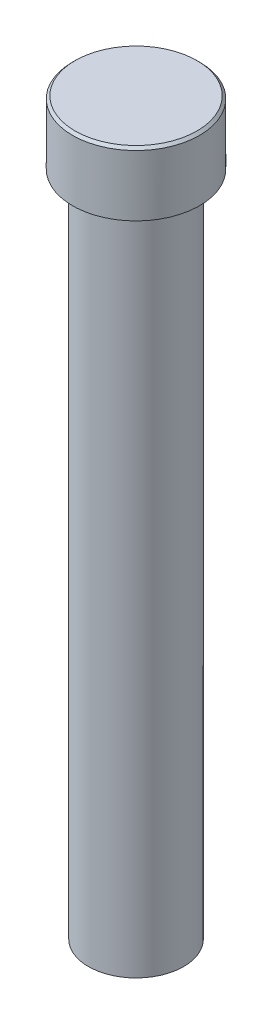
ISO-10303-21;
HEADER;
FILE_DESCRIPTION(('STEP AP214'),'2;1');
FILE_NAME('part.step','',(''),(''),'','','');
FILE_SCHEMA(('AUTOMOTIVE_DESIGN { 1 0 10303 214 1 1 1 1 }'));
ENDSEC;
DATA;
#1=APPLICATION_CONTEXT('core data for automotive mechanical design processes');
#2=APPLICATION_PROTOCOL_DEFINITION('international standard','automotive_design',2000,#1);
#3=PRODUCT_CONTEXT('',#1,'mechanical');
#4=PRODUCT('Part','Part','',(#3));
#5=PRODUCT_RELATED_PRODUCT_CATEGORY('part','',(#4));
#6=PRODUCT_DEFINITION_FORMATION('','',#4);
#7=PRODUCT_DEFINITION_CONTEXT('part definition',#1,'design');
#8=PRODUCT_DEFINITION('design','',#6,#7);
#9=PRODUCT_DEFINITION_SHAPE('','',#8);
#10=(LENGTH_UNIT() NAMED_UNIT(*) SI_UNIT(.MILLI.,.METRE.));
#11=(NAMED_UNIT(*) PLANE_ANGLE_UNIT() SI_UNIT($,.RADIAN.));
#12=(NAMED_UNIT(*) SI_UNIT($,.STERADIAN.) SOLID_ANGLE_UNIT());
#13=UNCERTAINTY_MEASURE_WITH_UNIT(LENGTH_MEASURE(1.E-05),#10,'distance_accuracy_value','');
#14=(GEOMETRIC_REPRESENTATION_CONTEXT(3) GLOBAL_UNCERTAINTY_ASSIGNED_CONTEXT((#13)) GLOBAL_UNIT_ASSIGNED_CONTEXT((#10,
#11,#12)) REPRESENTATION_CONTEXT('',''));
#15=CARTESIAN_POINT('',(0.,0.,0.));
#16=DIRECTION('',(0.,0.,1.));
#17=DIRECTION('',(1.,0.,0.));
#18=AXIS2_PLACEMENT_3D('',#15,#16,#17);
#19=CARTESIAN_POINT('',(0.,73.025,0.));
#20=DIRECTION('',(0.,1.,0.));
#21=DIRECTION('',(0.,0.,1.));
#22=AXIS2_PLACEMENT_3D('',#19,#20,#21);
#23=PLANE('',#22);
#24=CARTESIAN_POINT('',(0.,73.025,0.));
#25=DIRECTION('',(0.,1.,0.));
#26=DIRECTION('',(0.,0.,1.));
#27=AXIS2_PLACEMENT_3D('',#24,#25,#26);
#28=CIRCLE('',#27,6.09600000000001);
#29=CARTESIAN_POINT('',(0.,73.025,6.09600000000001));
#30=VERTEX_POINT('',#29);
#31=EDGE_CURVE('E10',#30,#30,#28,.T.);
#32=ORIENTED_EDGE('',*,*,#31,.T.);
#33=EDGE_LOOP('',(#32));
#34=FACE_BOUND('',#33,.T.);
#35=ADVANCED_FACE('F43',(#34),#23,.T.);
#36=CARTESIAN_POINT('',(0.,0.,0.));
#37=DIRECTION('',(0.,-1.,0.));
#38=DIRECTION('',(0.,0.,-1.));
#39=AXIS2_PLACEMENT_3D('',#36,#37,#38);
#40=CYLINDRICAL_SURFACE('',#39,6.35);
#41=CARTESIAN_POINT('',(0.,72.771,0.));
#42=DIRECTION('',(0.,1.,0.));
#43=DIRECTION('',(0.,0.,1.));
#44=AXIS2_PLACEMENT_3D('',#41,#42,#43);
#45=CIRCLE('',#44,6.35);
#46=CARTESIAN_POINT('',(0.,72.771,6.35));
#47=VERTEX_POINT('',#46);
#48=EDGE_CURVE('E52',#47,#47,#45,.F.);
#49=ORIENTED_EDGE('',*,*,#48,.T.);
#50=EDGE_LOOP('',(#49));
#51=FACE_BOUND('',#50,.T.);
#52=CARTESIAN_POINT('',(0.,66.675,0.));
#53=DIRECTION('',(0.,-1.,0.));
#54=DIRECTION('',(0.,0.,-1.));
#55=AXIS2_PLACEMENT_3D('',#52,#53,#54);
#56=CIRCLE('',#55,6.35);
#57=CARTESIAN_POINT('',(0.,66.675,-6.35));
#58=VERTEX_POINT('',#57);
#59=EDGE_CURVE('E57',#58,#58,#56,.T.);
#60=ORIENTED_EDGE('',*,*,#59,.F.);
#61=EDGE_LOOP('',(#60));
#62=FACE_BOUND('',#61,.T.);
#63=ADVANCED_FACE('F85',(#51,#62),#40,.T.);
#64=CARTESIAN_POINT('',(4.7625,66.675,0.));
#65=DIRECTION('',(0.,-1.,0.));
#66=DIRECTION('',(0.,0.,-1.));
#67=AXIS2_PLACEMENT_3D('',#64,#65,#66);
#68=PLANE('',#67);
#69=ORIENTED_EDGE('',*,*,#59,.T.);
#70=EDGE_LOOP('',(#69));
#71=FACE_BOUND('',#70,.T.);
#72=CARTESIAN_POINT('',(0.,66.675,0.));
#73=DIRECTION('',(0.,-1.,0.));
#74=DIRECTION('',(0.,0.,-1.));
#75=AXIS2_PLACEMENT_3D('',#72,#73,#74);
#76=CIRCLE('',#75,4.7625);
#77=CARTESIAN_POINT('',(0.,66.675,-4.7625));
#78=VERTEX_POINT('',#77);
#79=EDGE_CURVE('E62',#78,#78,#76,.T.);
#80=ORIENTED_EDGE('',*,*,#79,.F.);
#81=EDGE_LOOP('',(#80));
#82=FACE_BOUND('',#81,.T.);
#83=ADVANCED_FACE('F77',(#71,#82),#68,.T.);
#84=CARTESIAN_POINT('',(0.,0.,0.));
#85=DIRECTION('',(0.,-1.,0.));
#86=DIRECTION('',(0.,0.,-1.));
#87=AXIS2_PLACEMENT_3D('',#84,#85,#86);
#88=CYLINDRICAL_SURFACE('',#87,4.7625);
#89=ORIENTED_EDGE('',*,*,#79,.T.);
#90=EDGE_LOOP('',(#89));
#91=FACE_BOUND('',#90,.T.);
#92=CARTESIAN_POINT('',(0.,0.,0.));
#93=DIRECTION('',(0.,-1.,0.));
#94=DIRECTION('',(0.,0.,-1.));
#95=AXIS2_PLACEMENT_3D('',#92,#93,#94);
#96=CIRCLE('',#95,4.7625);
#97=CARTESIAN_POINT('',(0.,0.,-4.7625));
#98=VERTEX_POINT('',#97);
#99=EDGE_CURVE('E68',#98,#98,#96,.T.);
#100=ORIENTED_EDGE('',*,*,#99,.F.);
#101=EDGE_LOOP('',(#100));
#102=FACE_BOUND('',#101,.T.);
#103=ADVANCED_FACE('F75',(#91,#102),#88,.T.);
#104=CARTESIAN_POINT('',(0.,0.,0.));
#105=DIRECTION('',(0.,-1.,0.));
#106=DIRECTION('',(0.,0.,-1.));
#107=AXIS2_PLACEMENT_3D('',#104,#105,#106);
#108=PLANE('',#107);
#109=ORIENTED_EDGE('',*,*,#99,.T.);
#110=EDGE_LOOP('',(#109));
#111=FACE_BOUND('',#110,.T.);
#112=ADVANCED_FACE('F73',(#111),#108,.T.);
#113=CARTESIAN_POINT('',(0.,72.771,0.));
#114=DIRECTION('',(0.,-1.,0.));
#115=DIRECTION('',(0.,0.,-1.));
#116=AXIS2_PLACEMENT_3D('',#113,#114,#115);
#117=CONICAL_SURFACE('',#116,6.35,0.785398163397445);
#118=ORIENTED_EDGE('',*,*,#31,.F.);
#119=EDGE_LOOP('',(#118));
#120=FACE_BOUND('',#119,.T.);
#121=ORIENTED_EDGE('',*,*,#48,.F.);
#122=EDGE_LOOP('',(#121));
#123=FACE_BOUND('',#122,.T.);
#124=ADVANCED_FACE('F46',(#120,#123),#117,.T.);
#125=CLOSED_SHELL('',(#35,#63,#83,#103,#112,#124));
#126=MANIFOLD_SOLID_BREP('B2',#125);
#127=ADVANCED_BREP_SHAPE_REPRESENTATION('',(#18,#126),#14);
#128=SHAPE_DEFINITION_REPRESENTATION(#9,#127);
ENDSEC;
END-ISO-10303-21;
